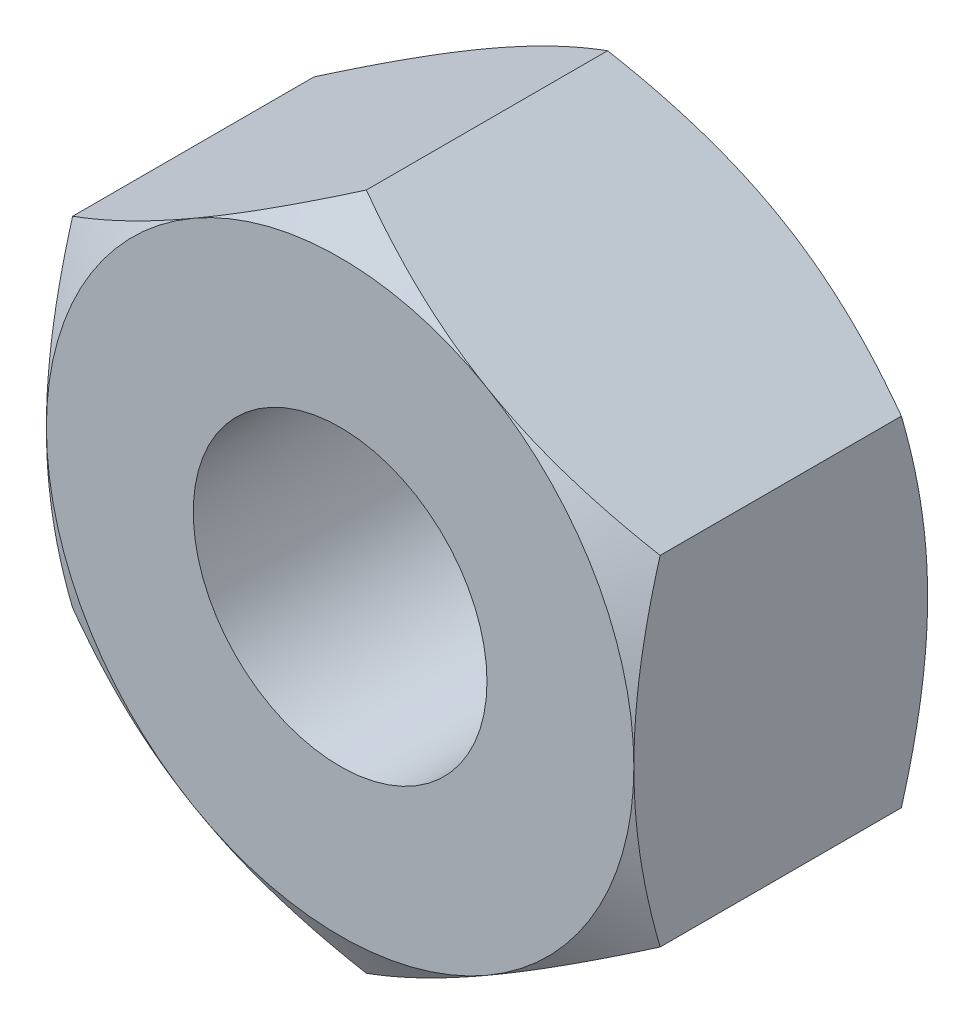
ISO-10303-21;
HEADER;
FILE_DESCRIPTION(('STEP AP214'),'2;1');
FILE_NAME('part.step','',(''),(''),'','','');
FILE_SCHEMA(('AUTOMOTIVE_DESIGN { 1 0 10303 214 1 1 1 1 }'));
ENDSEC;
DATA;
#1=APPLICATION_CONTEXT('core data for automotive mechanical design processes');
#2=APPLICATION_PROTOCOL_DEFINITION('international standard','automotive_design',2000,#1);
#3=PRODUCT_CONTEXT('',#1,'mechanical');
#4=PRODUCT('Part','Part','',(#3));
#5=PRODUCT_RELATED_PRODUCT_CATEGORY('part','',(#4));
#6=PRODUCT_DEFINITION_FORMATION('','',#4);
#7=PRODUCT_DEFINITION_CONTEXT('part definition',#1,'design');
#8=PRODUCT_DEFINITION('design','',#6,#7);
#9=PRODUCT_DEFINITION_SHAPE('','',#8);
#10=(LENGTH_UNIT() NAMED_UNIT(*) SI_UNIT(.MILLI.,.METRE.));
#11=(NAMED_UNIT(*) PLANE_ANGLE_UNIT() SI_UNIT($,.RADIAN.));
#12=(NAMED_UNIT(*) SI_UNIT($,.STERADIAN.) SOLID_ANGLE_UNIT());
#13=UNCERTAINTY_MEASURE_WITH_UNIT(LENGTH_MEASURE(1.E-05),#10,'distance_accuracy_value','');
#14=(GEOMETRIC_REPRESENTATION_CONTEXT(3) GLOBAL_UNCERTAINTY_ASSIGNED_CONTEXT((#13)) GLOBAL_UNIT_ASSIGNED_CONTEXT((#10,
#11,#12)) REPRESENTATION_CONTEXT('',''));
#15=CARTESIAN_POINT('',(0.,0.,0.));
#16=DIRECTION('',(0.,0.,1.));
#17=DIRECTION('',(1.,0.,0.));
#18=AXIS2_PLACEMENT_3D('',#15,#16,#17);
#19=CARTESIAN_POINT('',(0.,3.46410161513776,-3.));
#20=DIRECTION('',(-0.500000000000002,0.866025403784438,0.));
#21=DIRECTION('',(-0.866025403784438,-0.500000000000002,0.));
#22=AXIS2_PLACEMENT_3D('',#19,#20,#21);
#23=PLANE('',#22);
#24=DIRECTION('',(0.,0.,1.));
#25=VECTOR('',#24,1.);
#26=CARTESIAN_POINT('',(-3.,1.73205080756887,-3.));
#27=LINE('',#26,#25);
#28=CARTESIAN_POINT('',(-3.,1.73205080756889,-2.73205080756887));
#29=VERTEX_POINT('',#28);
#30=CARTESIAN_POINT('',(-3.,1.73205080756887,-0.267949192431122));
#31=VERTEX_POINT('',#30);
#32=EDGE_CURVE('E163',#29,#31,#27,.T.);
#33=ORIENTED_EDGE('',*,*,#32,.T.);
#34=CARTESIAN_POINT('',(-3.0002,1.73193533751504,-0.268015862431011));
#35=CARTESIAN_POINT('',(-2.86836479341167,1.80805042952748,-0.224053704452307));
#36=CARTESIAN_POINT('',(-2.73539159464475,1.88482254163056,-0.184071586292629));
#37=CARTESIAN_POINT('',(-2.46714257999794,2.03969618244675,-0.114282080445466));
#38=CARTESIAN_POINT('',(-2.33186199736566,2.11780046324563,-0.0844993822653804));
#39=CARTESIAN_POINT('',(-2.06297739790352,2.27304105912604,-0.0381378392112548));
#40=CARTESIAN_POINT('',(-1.92941475457054,2.35015348720802,-0.0212504411229499));
#41=CARTESIAN_POINT('',(-1.66166094270431,2.50474122256553,-0.00108964244852447));
#42=CARTESIAN_POINT('',(-1.52747074752016,2.58221596787771,0.00220045221891887));
#43=CARTESIAN_POINT('',(-1.2767244023042,2.72698443778646,-0.00464053088539122));
#44=CARTESIAN_POINT('',(-1.16013073502733,2.79429982297457,-0.0130919141926174));
#45=CARTESIAN_POINT('',(-0.927703015025365,2.92849202968484,-0.0398789430070364));
#46=CARTESIAN_POINT('',(-0.81186976634867,2.99536838698943,-0.0582237408617138));
#47=CARTESIAN_POINT('',(-0.578962742943633,3.12983731964849,-0.104084750853329));
#48=CARTESIAN_POINT('',(-0.46191844948606,3.19741287398333,-0.131795385263085));
#49=CARTESIAN_POINT('',(-0.229575649500876,3.33155605209905,-0.194687795137404));
#50=CARTESIAN_POINT('',(-0.114274165828894,3.39812539473503,-0.22985479102156));
#51=CARTESIAN_POINT('',(0.00019999999999989,3.4642170851916,-0.268015862431015));
#52=B_SPLINE_CURVE_WITH_KNOTS('',3,(#34,#35,#36,#37,#38,#39,#40,#41,#42,#43,#44,#45,#46,#47,#48,
#49,#50,#51),.UNSPECIFIED.,.F.,.F.,(4,2,2,2,2,2,2,2,4),(0.,0.475539830103041,0.952222784107964,
1.41710776961288,1.88142182298026,2.28572436316091,2.69040156475039,3.10405572063577,
3.51689749407071),.UNSPECIFIED.);
#53=CARTESIAN_POINT('',(-1.50000000000001,2.59807621135331,0.));
#54=VERTEX_POINT('',#53);
#55=EDGE_CURVE('E132',#31,#54,#52,.T.);
#56=ORIENTED_EDGE('',*,*,#55,.T.);
#57=CARTESIAN_POINT('',(0.,3.46410161513776,-0.267949192431126));
#58=VERTEX_POINT('',#57);
#59=EDGE_CURVE('E52',#54,#58,#52,.T.);
#60=ORIENTED_EDGE('',*,*,#59,.T.);
#61=DIRECTION('',(0.,0.,1.));
#62=VECTOR('',#61,1.);
#63=CARTESIAN_POINT('',(0.,3.46410161513776,-3.));
#64=LINE('',#63,#62);
#65=CARTESIAN_POINT('',(0.,3.46410161513776,-2.73205080756887));
#66=VERTEX_POINT('',#65);
#67=EDGE_CURVE('E148',#66,#58,#64,.T.);
#68=ORIENTED_EDGE('',*,*,#67,.F.);
#69=CARTESIAN_POINT('',(-3.0002,1.73193533751504,-2.73198413756899));
#70=CARTESIAN_POINT('',(-2.86836479341167,1.80805042952748,-2.77594629554769));
#71=CARTESIAN_POINT('',(-2.73539159464475,1.88482254163057,-2.81592841370737));
#72=CARTESIAN_POINT('',(-2.46714257999794,2.03969618244675,-2.88571791955453));
#73=CARTESIAN_POINT('',(-2.33186199736566,2.11780046324563,-2.91550061773462));
#74=CARTESIAN_POINT('',(-2.06297739790352,2.27304105912604,-2.96186216078874));
#75=CARTESIAN_POINT('',(-1.92941475457054,2.35015348720802,-2.97874955887705));
#76=CARTESIAN_POINT('',(-1.66166094270431,2.50474122256553,-2.99891035755148));
#77=CARTESIAN_POINT('',(-1.52747074752016,2.58221596787771,-3.00220045221892));
#78=CARTESIAN_POINT('',(-1.27672440230419,2.72698443778647,-2.99535946911461));
#79=CARTESIAN_POINT('',(-1.16013073502733,2.79429982297457,-2.98690808580738));
#80=CARTESIAN_POINT('',(-0.927703015025365,2.92849202968483,-2.96012105699296));
#81=CARTESIAN_POINT('',(-0.81186976634867,2.99536838698943,-2.94177625913829));
#82=CARTESIAN_POINT('',(-0.578962742943633,3.12983731964849,-2.89591524914667));
#83=CARTESIAN_POINT('',(-0.46191844948606,3.19741287398333,-2.86820461473691));
#84=CARTESIAN_POINT('',(-0.229575649500876,3.33155605209905,-2.8053122048626));
#85=CARTESIAN_POINT('',(-0.114274165828894,3.39812539473503,-2.77014520897844));
#86=CARTESIAN_POINT('',(0.000199999999999608,3.4642170851916,-2.73198413756899));
#87=B_SPLINE_CURVE_WITH_KNOTS('',3,(#69,#70,#71,#72,#73,#74,#75,#76,#77,#78,#79,#80,#81,#82,#83,
#84,#85,#86),.UNSPECIFIED.,.F.,.F.,(4,2,2,2,2,2,2,2,4),(0.,0.475539830103041,0.952222784107965,
1.41710776961288,1.88142182298026,2.28572436316091,2.69040156475039,3.10405572063577,
3.51689749407071),.UNSPECIFIED.);
#88=CARTESIAN_POINT('',(-1.50000000000001,2.59807621135331,-3.));
#89=VERTEX_POINT('',#88);
#90=EDGE_CURVE('E204',#89,#66,#87,.T.);
#91=ORIENTED_EDGE('',*,*,#90,.F.);
#92=EDGE_CURVE('E201',#29,#89,#87,.T.);
#93=ORIENTED_EDGE('',*,*,#92,.F.);
#94=EDGE_LOOP('',(#33,#56,#60,#68,#91,#93));
#95=FACE_BOUND('',#94,.T.);
#96=ADVANCED_FACE('F36',(#95),#23,.T.);
#97=CARTESIAN_POINT('',(3.,1.73205080756887,-3.));
#98=DIRECTION('',(0.500000000000002,0.866025403784438,0.));
#99=DIRECTION('',(-0.866025403784438,0.500000000000002,0.));
#100=AXIS2_PLACEMENT_3D('',#97,#98,#99);
#101=PLANE('',#100);
#102=ORIENTED_EDGE('',*,*,#67,.T.);
#103=CARTESIAN_POINT('',(-0.000200000000000468,3.4642170851916,-0.268015862431014));
#104=CARTESIAN_POINT('',(0.131635206588331,3.38810199317915,-0.22405370445231));
#105=CARTESIAN_POINT('',(0.264608405355248,3.31132988107607,-0.184071586292632));
#106=CARTESIAN_POINT('',(0.532857420002055,3.15645624025988,-0.114282080445468));
#107=CARTESIAN_POINT('',(0.668138002634341,3.078351959461,-0.0844993822653821));
#108=CARTESIAN_POINT('',(0.937022602096483,2.92311136358059,-0.0381378392112558));
#109=CARTESIAN_POINT('',(1.07058524542946,2.84599893549862,-0.0212504411229507));
#110=CARTESIAN_POINT('',(1.33833905729569,2.6914112001411,-0.00108964244852467));
#111=CARTESIAN_POINT('',(1.47252925247984,2.61393645482892,0.00220045221891905));
#112=CARTESIAN_POINT('',(1.72327559769581,2.46916798492017,-0.00464053088539054));
#113=CARTESIAN_POINT('',(1.83986926497268,2.40185259973206,-0.0130919141926165));
#114=CARTESIAN_POINT('',(2.07229698497464,2.2676603930218,-0.039878943007035));
#115=CARTESIAN_POINT('',(2.18813023365133,2.2007840357172,-0.058223740861712));
#116=CARTESIAN_POINT('',(2.42103725705637,2.06631510305815,-0.104084750853327));
#117=CARTESIAN_POINT('',(2.53808155051394,1.99873954872331,-0.131795385263083));
#118=CARTESIAN_POINT('',(2.77042435049913,1.86459637060759,-0.194687795137401));
#119=CARTESIAN_POINT('',(2.88572583417111,1.79802702797161,-0.229854791021557));
#120=CARTESIAN_POINT('',(3.0002,1.73193533751504,-0.268015862431011));
#121=B_SPLINE_CURVE_WITH_KNOTS('',3,(#103,#104,#105,#106,#107,#108,#109,#110,#111,#112,#113,
#114,#115,#116,#117,#118,#119,#120),.UNSPECIFIED.,.F.,.F.,(4,2,2,2,2,2,2,2,4),(0.,
0.475539830103041,0.952222784107966,1.41710776961288,1.88142182298026,2.28572436316091,
2.69040156475039,3.10405572063577,3.51689749407071),.UNSPECIFIED.);
#122=CARTESIAN_POINT('',(1.50000000000001,2.59807621135331,0.));
#123=VERTEX_POINT('',#122);
#124=EDGE_CURVE('E142',#58,#123,#121,.T.);
#125=ORIENTED_EDGE('',*,*,#124,.T.);
#126=CARTESIAN_POINT('',(3.,1.73205080756889,-0.267949192431126));
#127=VERTEX_POINT('',#126);
#128=EDGE_CURVE('E59',#123,#127,#121,.T.);
#129=ORIENTED_EDGE('',*,*,#128,.T.);
#130=DIRECTION('',(0.,0.,1.));
#131=VECTOR('',#130,1.);
#132=CARTESIAN_POINT('',(3.,1.73205080756887,-3.));
#133=LINE('',#132,#131);
#134=CARTESIAN_POINT('',(3.,1.73205080756889,-2.73205080756887));
#135=VERTEX_POINT('',#134);
#136=EDGE_CURVE('E141',#135,#127,#133,.T.);
#137=ORIENTED_EDGE('',*,*,#136,.F.);
#138=CARTESIAN_POINT('',(-0.000200000000000468,3.4642170851916,-2.73198413756899));
#139=CARTESIAN_POINT('',(0.131635206588332,3.38810199317915,-2.77594629554769));
#140=CARTESIAN_POINT('',(0.264608405355249,3.31132988107607,-2.81592841370737));
#141=CARTESIAN_POINT('',(0.532857420002055,3.15645624025988,-2.88571791955453));
#142=CARTESIAN_POINT('',(0.668138002634341,3.078351959461,-2.91550061773462));
#143=CARTESIAN_POINT('',(0.937022602096483,2.92311136358059,-2.96186216078874));
#144=CARTESIAN_POINT('',(1.07058524542946,2.84599893549862,-2.97874955887705));
#145=CARTESIAN_POINT('',(1.33833905729569,2.6914112001411,-2.99891035755148));
#146=CARTESIAN_POINT('',(1.47252925247984,2.61393645482892,-3.00220045221892));
#147=CARTESIAN_POINT('',(1.72327559769581,2.46916798492017,-2.99535946911461));
#148=CARTESIAN_POINT('',(1.83986926497268,2.40185259973206,-2.98690808580738));
#149=CARTESIAN_POINT('',(2.07229698497464,2.2676603930218,-2.96012105699296));
#150=CARTESIAN_POINT('',(2.18813023365133,2.2007840357172,-2.94177625913829));
#151=CARTESIAN_POINT('',(2.42103725705637,2.06631510305815,-2.89591524914667));
#152=CARTESIAN_POINT('',(2.53808155051394,1.99873954872331,-2.86820461473692));
#153=CARTESIAN_POINT('',(2.77042435049912,1.86459637060759,-2.8053122048626));
#154=CARTESIAN_POINT('',(2.88572583417111,1.79802702797161,-2.77014520897844));
#155=CARTESIAN_POINT('',(3.0002,1.73193533751504,-2.73198413756899));
#156=B_SPLINE_CURVE_WITH_KNOTS('',3,(#138,#139,#140,#141,#142,#143,#144,#145,#146,#147,#148,
#149,#150,#151,#152,#153,#154,#155),.UNSPECIFIED.,.F.,.F.,(4,2,2,2,2,2,2,2,4),(0.,
0.475539830103042,0.952222784107966,1.41710776961288,1.88142182298026,2.28572436316091,
2.69040156475039,3.10405572063577,3.51689749407071),.UNSPECIFIED.);
#157=CARTESIAN_POINT('',(1.50000000000001,2.59807621135331,-3.));
#158=VERTEX_POINT('',#157);
#159=EDGE_CURVE('E212',#158,#135,#156,.T.);
#160=ORIENTED_EDGE('',*,*,#159,.F.);
#161=EDGE_CURVE('E213',#66,#158,#156,.T.);
#162=ORIENTED_EDGE('',*,*,#161,.F.);
#163=EDGE_LOOP('',(#102,#125,#129,#137,#160,#162));
#164=FACE_BOUND('',#163,.T.);
#165=ADVANCED_FACE('F139',(#164),#101,.T.);
#166=CARTESIAN_POINT('',(3.,1.73205080756887,-3.));
#167=DIRECTION('',(-1.,0.,0.));
#168=DIRECTION('',(0.,0.,1.));
#169=AXIS2_PLACEMENT_3D('',#166,#167,#168);
#170=PLANE('',#169);
#171=CARTESIAN_POINT('',(3.,-4.5936539924692,-1.43558011593048));
#172=CARTESIAN_POINT('',(3.,-4.46193702779008,-1.37192720307518));
#173=CARTESIAN_POINT('',(3.,-4.32990864071465,-1.30890705285555));
#174=CARTESIAN_POINT('',(3.,-4.06506063583466,-1.18449386009788));
#175=CARTESIAN_POINT('',(3.,-3.93224088584946,-1.12310109927543));
#176=CARTESIAN_POINT('',(3.,-3.66492428764751,-1.00198084729392));
#177=CARTESIAN_POINT('',(3.,-3.53042219167022,-0.942264896297281));
#178=CARTESIAN_POINT('',(3.,-3.26031251060448,-0.825397939065226));
#179=CARTESIAN_POINT('',(3.,-3.12470498357654,-0.768246799131018));
#180=CARTESIAN_POINT('',(3.,-2.85048530058733,-0.656512987795774));
#181=CARTESIAN_POINT('',(3.,-2.71185669617078,-0.601970463161886));
#182=CARTESIAN_POINT('',(3.,-2.43296435096227,-0.497157173219567));
#183=CARTESIAN_POINT('',(3.,-2.29270043021851,-0.44688688317488));
#184=CARTESIAN_POINT('',(3.,-2.01060238690328,-0.351968811323162));
#185=CARTESIAN_POINT('',(3.,-1.86877232784637,-0.307309076087879));
#186=CARTESIAN_POINT('',(3.,-1.58309590976889,-0.225062517408381));
#187=CARTESIAN_POINT('',(3.,-1.43925020389312,-0.187473457257565));
#188=CARTESIAN_POINT('',(3.,-1.1494442452365,-0.121193096215532));
#189=CARTESIAN_POINT('',(3.,-1.00348344023738,-0.0925041644674057));
#190=CARTESIAN_POINT('',(3.,-0.709802044404419,-0.0459556769417578));
#191=CARTESIAN_POINT('',(3.,-0.562081452014834,-0.0280961307387742));
#192=CARTESIAN_POINT('',(3.,-0.266588992220961,-0.00478635986207698));
#193=CARTESIAN_POINT('',(3.,-0.118823483320512,0.00074242557078129));
#194=CARTESIAN_POINT('',(3.,0.176604064205598,-0.000903049781096435));
#195=CARTESIAN_POINT('',(3.,0.32426611973415,-0.00807401311151281));
#196=CARTESIAN_POINT('',(3.,0.576420476419134,-0.0306590509601927));
#197=CARTESIAN_POINT('',(3.,0.681190963786361,-0.0431319720329319));
#198=CARTESIAN_POINT('',(3.,0.889922617976225,-0.0736600577600183));
#199=CARTESIAN_POINT('',(3.,0.993883654507595,-0.0917161027938342));
#200=CARTESIAN_POINT('',(3.,1.30446784089727,-0.153311303212673));
#201=CARTESIAN_POINT('',(3.,1.50963517896541,-0.204261664818864));
#202=CARTESIAN_POINT('',(3.,1.81663689760892,-0.292137269487902));
#203=CARTESIAN_POINT('',(3.,1.92007152271153,-0.323785456358726));
#204=CARTESIAN_POINT('',(3.,2.12586119326052,-0.390213435170821));
#205=CARTESIAN_POINT('',(3.,2.22821692967668,-0.424991067140183));
#206=CARTESIAN_POINT('',(3.,2.43142080387255,-0.496954274385214));
#207=CARTESIAN_POINT('',(3.,2.53227418460128,-0.534125194315124));
#208=CARTESIAN_POINT('',(3.,2.73319845864685,-0.610648765343025));
#209=CARTESIAN_POINT('',(3.,2.8332690167954,-0.650002298222526));
#210=CARTESIAN_POINT('',(3.,2.93297774240013,-0.690231754906343));
#211=B_SPLINE_CURVE_WITH_KNOTS('',3,(#171,#172,#173,#174,#175,#176,#177,#178,#179,#180,#181,
#182,#183,#184,#185,#186,#187,#188,#189,#190,#191,#192,#193,#194,#195,#196,#197,#198,#199,#200,
#201,#202,#203,#204,#205,#206,#207,#208,#209,#210),.UNSPECIFIED.,.F.,.F.,(4,2,2,2,2,2,2,2,2,2,2,
2,2,2,2,2,2,2,2,4),(0.,0.438878844399204,0.877833172949451,1.31929945984492,1.7607427071362,
2.20760550748113,2.65451795408017,3.10046148523201,3.54626371043603,3.99218450300884,
4.4381056898311,4.88117764390528,5.32413457244915,5.64051105619141,5.9569374534813,
6.59026118519872,6.91473961423267,7.23899577837223,7.56142681097228,7.88398906914351),.UNSPECIFIED.);
#212=CARTESIAN_POINT('',(3.,-1.73205080756889,-0.267949192431126));
#213=VERTEX_POINT('',#212);
#214=CARTESIAN_POINT('',(3.,0.,0.));
#215=VERTEX_POINT('',#214);
#216=EDGE_CURVE('E134',#213,#215,#211,.T.);
#217=ORIENTED_EDGE('',*,*,#216,.F.);
#218=DIRECTION('',(0.,0.,1.));
#219=VECTOR('',#218,1.);
#220=CARTESIAN_POINT('',(3.,-1.73205080756889,-3.));
#221=LINE('',#220,#219);
#222=CARTESIAN_POINT('',(3.,-1.73205080756889,-2.73205080756887));
#223=VERTEX_POINT('',#222);
#224=EDGE_CURVE('E149',#223,#213,#221,.T.);
#225=ORIENTED_EDGE('',*,*,#224,.F.);
#226=CARTESIAN_POINT('',(3.,-4.5936539924692,-1.56441988406951));
#227=CARTESIAN_POINT('',(3.,-4.46193702779008,-1.62807279692482));
#228=CARTESIAN_POINT('',(3.,-4.32990864071465,-1.69109294714445));
#229=CARTESIAN_POINT('',(3.,-4.06506063583466,-1.81550613990212));
#230=CARTESIAN_POINT('',(3.,-3.93224088584946,-1.87689890072457));
#231=CARTESIAN_POINT('',(3.,-3.66492428764751,-1.99801915270608));
#232=CARTESIAN_POINT('',(3.,-3.53042219167022,-2.05773510370272));
#233=CARTESIAN_POINT('',(3.,-3.26031251060448,-2.17460206093477));
#234=CARTESIAN_POINT('',(3.,-3.12470498357654,-2.23175320086898));
#235=CARTESIAN_POINT('',(3.,-2.85048530058734,-2.34348701220423));
#236=CARTESIAN_POINT('',(3.,-2.71185669617078,-2.39802953683811));
#237=CARTESIAN_POINT('',(3.,-2.43296435096227,-2.50284282678043));
#238=CARTESIAN_POINT('',(3.,-2.29270043021851,-2.55311311682512));
#239=CARTESIAN_POINT('',(3.,-2.01060238690328,-2.64803118867684));
#240=CARTESIAN_POINT('',(3.,-1.86877232784637,-2.69269092391212));
#241=CARTESIAN_POINT('',(3.,-1.58309590976889,-2.77493748259162));
#242=CARTESIAN_POINT('',(3.,-1.43925020389312,-2.81252654274243));
#243=CARTESIAN_POINT('',(3.,-1.1494442452365,-2.87880690378447));
#244=CARTESIAN_POINT('',(3.,-1.00348344023738,-2.90749583553259));
#245=CARTESIAN_POINT('',(3.,-0.709802044404419,-2.95404432305824));
#246=CARTESIAN_POINT('',(3.,-0.562081452014834,-2.97190386926123));
#247=CARTESIAN_POINT('',(3.,-0.26658899222096,-2.99521364013792));
#248=CARTESIAN_POINT('',(3.,-0.118823483320512,-3.00074242557078));
#249=CARTESIAN_POINT('',(3.,0.176604064205598,-2.9990969502189));
#250=CARTESIAN_POINT('',(3.,0.324266119734151,-2.99192598688849));
#251=CARTESIAN_POINT('',(3.,0.576420476419134,-2.96934094903981));
#252=CARTESIAN_POINT('',(3.,0.681190963786361,-2.95686802796707));
#253=CARTESIAN_POINT('',(3.,0.889922617976226,-2.92633994223998));
#254=CARTESIAN_POINT('',(3.,0.993883654507595,-2.90828389720617));
#255=CARTESIAN_POINT('',(3.,1.30446784089726,-2.84668869678733));
#256=CARTESIAN_POINT('',(3.,1.50963517896541,-2.79573833518114));
#257=CARTESIAN_POINT('',(3.,1.81663689760892,-2.7078627305121));
#258=CARTESIAN_POINT('',(3.,1.92007152271153,-2.67621454364127));
#259=CARTESIAN_POINT('',(3.,2.12586119326052,-2.60978656482918));
#260=CARTESIAN_POINT('',(3.,2.22821692967667,-2.57500893285982));
#261=CARTESIAN_POINT('',(3.,2.43142080387255,-2.50304572561479));
#262=CARTESIAN_POINT('',(3.,2.53227418460128,-2.46587480568488));
#263=CARTESIAN_POINT('',(3.,2.73319845864685,-2.38935123465697));
#264=CARTESIAN_POINT('',(3.,2.8332690167954,-2.34999770177747));
#265=CARTESIAN_POINT('',(3.,2.93297774240012,-2.30976824509366));
#266=B_SPLINE_CURVE_WITH_KNOTS('',3,(#226,#227,#228,#229,#230,#231,#232,#233,#234,#235,#236,
#237,#238,#239,#240,#241,#242,#243,#244,#245,#246,#247,#248,#249,#250,#251,#252,#253,#254,#255,
#256,#257,#258,#259,#260,#261,#262,#263,#264,#265),.UNSPECIFIED.,.F.,.F.,(4,2,2,2,2,2,2,2,2,2,2,
2,2,2,2,2,2,2,2,4),(0.,0.438878844399204,0.877833172949452,1.31929945984492,1.7607427071362,
2.20760550748113,2.65451795408017,3.10046148523201,3.54626371043604,3.99218450300884,
4.4381056898311,4.88117764390528,5.32413457244915,5.64051105619141,5.9569374534813,
6.59026118519872,6.91473961423267,7.23899577837223,7.56142681097228,7.88398906914351),.UNSPECIFIED.);
#267=CARTESIAN_POINT('',(3.,0.,-3.));
#268=VERTEX_POINT('',#267);
#269=EDGE_CURVE('E187',#223,#268,#266,.T.);
#270=ORIENTED_EDGE('',*,*,#269,.T.);
#271=EDGE_CURVE('E147',#268,#135,#266,.T.);
#272=ORIENTED_EDGE('',*,*,#271,.T.);
#273=ORIENTED_EDGE('',*,*,#136,.T.);
#274=EDGE_CURVE('E124',#215,#127,#211,.T.);
#275=ORIENTED_EDGE('',*,*,#274,.F.);
#276=EDGE_LOOP('',(#217,#225,#270,#272,#273,#275));
#277=FACE_BOUND('',#276,.T.);
#278=ADVANCED_FACE('F145',(#277),#170,.F.);
#279=CARTESIAN_POINT('',(0.,-3.46410161513777,-3.));
#280=DIRECTION('',(0.500000000000002,-0.866025403784438,0.));
#281=DIRECTION('',(0.866025403784438,0.500000000000002,0.));
#282=AXIS2_PLACEMENT_3D('',#279,#280,#281);
#283=PLANE('',#282);
#284=ORIENTED_EDGE('',*,*,#224,.T.);
#285=CARTESIAN_POINT('',(3.0002,-1.73193533751505,-0.268015862431014));
#286=CARTESIAN_POINT('',(2.86836479341167,-1.80805042952749,-0.22405370445231));
#287=CARTESIAN_POINT('',(2.73539159464475,-1.88482254163058,-0.184071586292632));
#288=CARTESIAN_POINT('',(2.46714257999794,-2.03969618244676,-0.11428208044547));
#289=CARTESIAN_POINT('',(2.33186199736566,-2.11780046324564,-0.0844993822653846));
#290=CARTESIAN_POINT('',(2.06297739790352,-2.27304105912606,-0.0381378392112593));
#291=CARTESIAN_POINT('',(1.92941475457054,-2.35015348720803,-0.0212504411229545));
#292=CARTESIAN_POINT('',(1.66166094270431,-2.50474122256555,-0.00108964244852956));
#293=CARTESIAN_POINT('',(1.52747074752016,-2.58221596787773,0.00220045221891347));
#294=CARTESIAN_POINT('',(1.27672440230419,-2.72698443778648,-0.00464053088539715));
#295=CARTESIAN_POINT('',(1.16013073502732,-2.79429982297458,-0.0130919141926234));
#296=CARTESIAN_POINT('',(0.927703015025363,-2.92849202968485,-0.0398789430070428));
#297=CARTESIAN_POINT('',(0.811869766348668,-2.99536838698945,-0.0582237408617204));
#298=CARTESIAN_POINT('',(0.578962742943632,-3.1298373196485,-0.104084750853336));
#299=CARTESIAN_POINT('',(0.461918449486059,-3.19741287398334,-0.131795385263092));
#300=CARTESIAN_POINT('',(0.229575649500875,-3.33155605209906,-0.194687795137411));
#301=CARTESIAN_POINT('',(0.114274165828893,-3.39812539473504,-0.229854791021566));
#302=CARTESIAN_POINT('',(-0.000200000000000371,-3.46421708519161,-0.268015862431021));
#303=B_SPLINE_CURVE_WITH_KNOTS('',3,(#285,#286,#287,#288,#289,#290,#291,#292,#293,#294,#295,
#296,#297,#298,#299,#300,#301,#302),.UNSPECIFIED.,.F.,.F.,(4,2,2,2,2,2,2,2,4),(0.,
0.475539830103041,0.952222784107966,1.41710776961288,1.88142182298026,2.28572436316091,
2.69040156475039,3.10405572063577,3.51689749407071),.UNSPECIFIED.);
#304=CARTESIAN_POINT('',(1.50000000000001,-2.59807621135331,0.));
#305=VERTEX_POINT('',#304);
#306=EDGE_CURVE('E271',#213,#305,#303,.T.);
#307=ORIENTED_EDGE('',*,*,#306,.T.);
#308=CARTESIAN_POINT('',(0.,-3.46410161513776,-0.267949192431126));
#309=VERTEX_POINT('',#308);
#310=EDGE_CURVE('E265',#305,#309,#303,.T.);
#311=ORIENTED_EDGE('',*,*,#310,.T.);
#312=DIRECTION('',(0.,0.,1.));
#313=VECTOR('',#312,1.);
#314=CARTESIAN_POINT('',(0.,-3.46410161513777,-3.));
#315=LINE('',#314,#313);
#316=CARTESIAN_POINT('',(0.,-3.46410161513776,-2.73205080756887));
#317=VERTEX_POINT('',#316);
#318=EDGE_CURVE('E154',#317,#309,#315,.T.);
#319=ORIENTED_EDGE('',*,*,#318,.F.);
#320=CARTESIAN_POINT('',(3.0002,-1.73193533751505,-2.73198413756899));
#321=CARTESIAN_POINT('',(2.86836479341167,-1.80805042952749,-2.77594629554769));
#322=CARTESIAN_POINT('',(2.73539159464475,-1.88482254163058,-2.81592841370737));
#323=CARTESIAN_POINT('',(2.46714257999794,-2.03969618244676,-2.88571791955453));
#324=CARTESIAN_POINT('',(2.33186199736566,-2.11780046324564,-2.91550061773462));
#325=CARTESIAN_POINT('',(2.06297739790352,-2.27304105912606,-2.96186216078874));
#326=CARTESIAN_POINT('',(1.92941475457054,-2.35015348720803,-2.97874955887705));
#327=CARTESIAN_POINT('',(1.66166094270431,-2.50474122256555,-2.99891035755147));
#328=CARTESIAN_POINT('',(1.52747074752016,-2.58221596787773,-3.00220045221891));
#329=CARTESIAN_POINT('',(1.27672440230419,-2.72698443778648,-2.9953594691146));
#330=CARTESIAN_POINT('',(1.16013073502732,-2.79429982297458,-2.98690808580738));
#331=CARTESIAN_POINT('',(0.927703015025362,-2.92849202968485,-2.96012105699296));
#332=CARTESIAN_POINT('',(0.811869766348668,-2.99536838698945,-2.94177625913828));
#333=CARTESIAN_POINT('',(0.578962742943632,-3.1298373196485,-2.89591524914666));
#334=CARTESIAN_POINT('',(0.461918449486059,-3.19741287398334,-2.86820461473691));
#335=CARTESIAN_POINT('',(0.229575649500875,-3.33155605209906,-2.80531220486259));
#336=CARTESIAN_POINT('',(0.114274165828894,-3.39812539473504,-2.77014520897843));
#337=CARTESIAN_POINT('',(-0.000200000000000133,-3.46421708519161,-2.73198413756898));
#338=B_SPLINE_CURVE_WITH_KNOTS('',3,(#320,#321,#322,#323,#324,#325,#326,#327,#328,#329,#330,
#331,#332,#333,#334,#335,#336,#337),.UNSPECIFIED.,.F.,.F.,(4,2,2,2,2,2,2,2,4),(0.,
0.475539830103042,0.952222784107966,1.41710776961288,1.88142182298026,2.28572436316091,
2.69040156475039,3.10405572063577,3.51689749407071),.UNSPECIFIED.);
#339=CARTESIAN_POINT('',(1.5,-2.59807621135331,-3.));
#340=VERTEX_POINT('',#339);
#341=EDGE_CURVE('E205',#340,#317,#338,.T.);
#342=ORIENTED_EDGE('',*,*,#341,.F.);
#343=EDGE_CURVE('E189',#223,#340,#338,.T.);
#344=ORIENTED_EDGE('',*,*,#343,.F.);
#345=EDGE_LOOP('',(#284,#307,#311,#319,#342,#344));
#346=FACE_BOUND('',#345,.T.);
#347=ADVANCED_FACE('F256',(#346),#283,.T.);
#348=CARTESIAN_POINT('',(-3.,-1.73205080756889,-3.));
#349=DIRECTION('',(-0.500000000000002,-0.866025403784438,0.));
#350=DIRECTION('',(0.866025403784438,-0.500000000000002,0.));
#351=AXIS2_PLACEMENT_3D('',#348,#349,#350);
#352=PLANE('',#351);
#353=ORIENTED_EDGE('',*,*,#318,.T.);
#354=CARTESIAN_POINT('',(0.0002,-3.46421708519161,-0.268015862431021));
#355=CARTESIAN_POINT('',(-0.131635206588332,-3.38810199317916,-0.224053704452316));
#356=CARTESIAN_POINT('',(-0.26460840535525,-3.31132988107608,-0.184071586292638));
#357=CARTESIAN_POINT('',(-0.532857420002057,-3.15645624025989,-0.114282080445474));
#358=CARTESIAN_POINT('',(-0.668138002634344,-3.07835195946101,-0.0844993822653882));
#359=CARTESIAN_POINT('',(-0.937022602096486,-2.9231113635806,-0.0381378392112617));
#360=CARTESIAN_POINT('',(-1.07058524542946,-2.84599893549863,-0.0212504411229563));
#361=CARTESIAN_POINT('',(-1.3383390572957,-2.69141120014111,-0.00108964244853018));
#362=CARTESIAN_POINT('',(-1.47252925247985,-2.61393645482893,0.00220045221891338));
#363=CARTESIAN_POINT('',(-1.72327559769581,-2.46916798492018,-0.00464053088539624));
#364=CARTESIAN_POINT('',(-1.83986926497268,-2.40185259973207,-0.013091914192622));
#365=CARTESIAN_POINT('',(-2.07229698497464,-2.26766039302181,-0.0398789430070403));
#366=CARTESIAN_POINT('',(-2.18813023365133,-2.20078403571721,-0.0582237408617173));
#367=CARTESIAN_POINT('',(-2.42103725705637,-2.06631510305816,-0.104084750853332));
#368=CARTESIAN_POINT('',(-2.53808155051394,-1.99873954872332,-0.131795385263087));
#369=CARTESIAN_POINT('',(-2.77042435049913,-1.8645963706076,-0.194687795137405));
#370=CARTESIAN_POINT('',(-2.88572583417111,-1.79802702797162,-0.22985479102156));
#371=CARTESIAN_POINT('',(-3.0002,-1.73193533751505,-0.268015862431014));
#372=B_SPLINE_CURVE_WITH_KNOTS('',3,(#354,#355,#356,#357,#358,#359,#360,#361,#362,#363,#364,
#365,#366,#367,#368,#369,#370,#371),.UNSPECIFIED.,.F.,.F.,(4,2,2,2,2,2,2,2,4),(0.,
0.475539830103043,0.952222784107969,1.41710776961289,1.88142182298027,2.28572436316092,
2.69040156475039,3.10405572063577,3.51689749407071),.UNSPECIFIED.);
#373=CARTESIAN_POINT('',(-1.50000000000001,-2.59807621135331,0.));
#374=VERTEX_POINT('',#373);
#375=EDGE_CURVE('E272',#309,#374,#372,.T.);
#376=ORIENTED_EDGE('',*,*,#375,.T.);
#377=CARTESIAN_POINT('',(-3.,-1.73205080756889,-0.267949192431126));
#378=VERTEX_POINT('',#377);
#379=EDGE_CURVE('E273',#374,#378,#372,.T.);
#380=ORIENTED_EDGE('',*,*,#379,.T.);
#381=DIRECTION('',(0.,0.,1.));
#382=VECTOR('',#381,1.);
#383=CARTESIAN_POINT('',(-3.,-1.73205080756889,-3.));
#384=LINE('',#383,#382);
#385=CARTESIAN_POINT('',(-3.,-1.73205080756889,-2.73205080756887));
#386=VERTEX_POINT('',#385);
#387=EDGE_CURVE('E160',#386,#378,#384,.T.);
#388=ORIENTED_EDGE('',*,*,#387,.F.);
#389=CARTESIAN_POINT('',(0.0002,-3.46421708519161,-2.73198413756898));
#390=CARTESIAN_POINT('',(-0.131635206588332,-3.38810199317916,-2.77594629554768));
#391=CARTESIAN_POINT('',(-0.26460840535525,-3.31132988107608,-2.81592841370736));
#392=CARTESIAN_POINT('',(-0.532857420002057,-3.15645624025989,-2.88571791955453));
#393=CARTESIAN_POINT('',(-0.668138002634344,-3.07835195946101,-2.91550061773461));
#394=CARTESIAN_POINT('',(-0.937022602096487,-2.9231113635806,-2.96186216078874));
#395=CARTESIAN_POINT('',(-1.07058524542946,-2.84599893549863,-2.97874955887704));
#396=CARTESIAN_POINT('',(-1.3383390572957,-2.69141120014111,-2.99891035755147));
#397=CARTESIAN_POINT('',(-1.47252925247985,-2.61393645482893,-3.00220045221891));
#398=CARTESIAN_POINT('',(-1.72327559769581,-2.46916798492017,-2.9953594691146));
#399=CARTESIAN_POINT('',(-1.83986926497268,-2.40185259973207,-2.98690808580738));
#400=CARTESIAN_POINT('',(-2.07229698497464,-2.26766039302181,-2.96012105699296));
#401=CARTESIAN_POINT('',(-2.18813023365133,-2.20078403571721,-2.94177625913828));
#402=CARTESIAN_POINT('',(-2.42103725705637,-2.06631510305816,-2.89591524914667));
#403=CARTESIAN_POINT('',(-2.53808155051394,-1.99873954872332,-2.86820461473691));
#404=CARTESIAN_POINT('',(-2.77042435049913,-1.8645963706076,-2.80531220486259));
#405=CARTESIAN_POINT('',(-2.88572583417111,-1.79802702797162,-2.77014520897844));
#406=CARTESIAN_POINT('',(-3.0002,-1.73193533751505,-2.73198413756899));
#407=B_SPLINE_CURVE_WITH_KNOTS('',3,(#389,#390,#391,#392,#393,#394,#395,#396,#397,#398,#399,
#400,#401,#402,#403,#404,#405,#406),.UNSPECIFIED.,.F.,.F.,(4,2,2,2,2,2,2,2,4),(0.,
0.475539830103043,0.952222784107969,1.41710776961289,1.88142182298027,2.28572436316092,
2.69040156475039,3.10405572063577,3.51689749407071),.UNSPECIFIED.);
#408=CARTESIAN_POINT('',(-1.5,-2.59807621135331,-3.));
#409=VERTEX_POINT('',#408);
#410=EDGE_CURVE('E245',#409,#386,#407,.T.);
#411=ORIENTED_EDGE('',*,*,#410,.F.);
#412=EDGE_CURVE('E255',#317,#409,#407,.T.);
#413=ORIENTED_EDGE('',*,*,#412,.F.);
#414=EDGE_LOOP('',(#353,#376,#380,#388,#411,#413));
#415=FACE_BOUND('',#414,.T.);
#416=ADVANCED_FACE('F259',(#415),#352,.T.);
#417=CARTESIAN_POINT('',(-3.,1.73205080756887,-3.));
#418=DIRECTION('',(-1.,0.,0.));
#419=DIRECTION('',(0.,0.,1.));
#420=AXIS2_PLACEMENT_3D('',#417,#418,#419);
#421=PLANE('',#420);
#422=ORIENTED_EDGE('',*,*,#387,.T.);
#423=CARTESIAN_POINT('',(-3.,-4.5936539924692,-1.43558011593048));
#424=CARTESIAN_POINT('',(-3.,-4.46193702779008,-1.37192720307518));
#425=CARTESIAN_POINT('',(-3.,-4.32990864071465,-1.30890705285555));
#426=CARTESIAN_POINT('',(-3.,-4.06506063583466,-1.18449386009788));
#427=CARTESIAN_POINT('',(-3.,-3.93224088584946,-1.12310109927543));
#428=CARTESIAN_POINT('',(-3.,-3.66492428764751,-1.00198084729392));
#429=CARTESIAN_POINT('',(-3.,-3.53042219167022,-0.942264896297281));
#430=CARTESIAN_POINT('',(-3.,-3.26031251060448,-0.825397939065226));
#431=CARTESIAN_POINT('',(-3.,-3.12470498357654,-0.768246799131018));
#432=CARTESIAN_POINT('',(-3.,-2.85048530058733,-0.656512987795774));
#433=CARTESIAN_POINT('',(-3.,-2.71185669617078,-0.601970463161886));
#434=CARTESIAN_POINT('',(-3.,-2.43296435096227,-0.497157173219567));
#435=CARTESIAN_POINT('',(-3.,-2.29270043021851,-0.44688688317488));
#436=CARTESIAN_POINT('',(-3.,-2.01060238690328,-0.351968811323162));
#437=CARTESIAN_POINT('',(-3.,-1.86877232784637,-0.307309076087879));
#438=CARTESIAN_POINT('',(-3.,-1.58309590976889,-0.225062517408381));
#439=CARTESIAN_POINT('',(-3.,-1.43925020389312,-0.187473457257565));
#440=CARTESIAN_POINT('',(-3.,-1.1494442452365,-0.121193096215532));
#441=CARTESIAN_POINT('',(-3.,-1.00348344023738,-0.0925041644674057));
#442=CARTESIAN_POINT('',(-3.,-0.709802044404419,-0.0459556769417578));
#443=CARTESIAN_POINT('',(-3.,-0.562081452014834,-0.0280961307387742));
#444=CARTESIAN_POINT('',(-3.,-0.266588992220961,-0.00478635986207698));
#445=CARTESIAN_POINT('',(-3.,-0.118823483320512,0.00074242557078129));
#446=CARTESIAN_POINT('',(-3.,0.176604064205598,-0.000903049781096435));
#447=CARTESIAN_POINT('',(-3.,0.32426611973415,-0.00807401311151281));
#448=CARTESIAN_POINT('',(-3.,0.576420476419134,-0.0306590509601927));
#449=CARTESIAN_POINT('',(-3.,0.681190963786361,-0.0431319720329319));
#450=CARTESIAN_POINT('',(-3.,0.889922617976225,-0.0736600577600183));
#451=CARTESIAN_POINT('',(-3.,0.993883654507595,-0.0917161027938342));
#452=CARTESIAN_POINT('',(-3.,1.30446784089727,-0.153311303212673));
#453=CARTESIAN_POINT('',(-3.,1.50963517896541,-0.204261664818864));
#454=CARTESIAN_POINT('',(-3.,1.81663689760892,-0.292137269487902));
#455=CARTESIAN_POINT('',(-3.,1.92007152271153,-0.323785456358726));
#456=CARTESIAN_POINT('',(-3.,2.12586119326052,-0.390213435170821));
#457=CARTESIAN_POINT('',(-3.,2.22821692967668,-0.424991067140183));
#458=CARTESIAN_POINT('',(-3.,2.43142080387255,-0.496954274385214));
#459=CARTESIAN_POINT('',(-3.,2.53227418460128,-0.534125194315124));
#460=CARTESIAN_POINT('',(-3.,2.73319845864685,-0.610648765343025));
#461=CARTESIAN_POINT('',(-3.,2.8332690167954,-0.650002298222526));
#462=CARTESIAN_POINT('',(-3.,2.93297774240013,-0.690231754906343));
#463=B_SPLINE_CURVE_WITH_KNOTS('',3,(#423,#424,#425,#426,#427,#428,#429,#430,#431,#432,#433,
#434,#435,#436,#437,#438,#439,#440,#441,#442,#443,#444,#445,#446,#447,#448,#449,#450,#451,#452,
#453,#454,#455,#456,#457,#458,#459,#460,#461,#462),.UNSPECIFIED.,.F.,.F.,(4,2,2,2,2,2,2,2,2,2,2,
2,2,2,2,2,2,2,2,4),(0.,0.438878844399204,0.877833172949451,1.31929945984492,1.7607427071362,
2.20760550748113,2.65451795408017,3.10046148523201,3.54626371043603,3.99218450300884,
4.4381056898311,4.88117764390528,5.32413457244915,5.64051105619141,5.9569374534813,
6.59026118519872,6.91473961423267,7.23899577837223,7.56142681097228,7.88398906914351),.UNSPECIFIED.);
#464=CARTESIAN_POINT('',(-3.,0.,0.));
#465=VERTEX_POINT('',#464);
#466=EDGE_CURVE('E448',#378,#465,#463,.T.);
#467=ORIENTED_EDGE('',*,*,#466,.T.);
#468=EDGE_CURVE('E443',#465,#31,#463,.T.);
#469=ORIENTED_EDGE('',*,*,#468,.T.);
#470=ORIENTED_EDGE('',*,*,#32,.F.);
#471=CARTESIAN_POINT('',(-3.,-4.5936539924692,-1.56441988406951));
#472=CARTESIAN_POINT('',(-3.,-4.46193702779008,-1.62807279692482));
#473=CARTESIAN_POINT('',(-3.,-4.32990864071465,-1.69109294714445));
#474=CARTESIAN_POINT('',(-3.,-4.06506063583466,-1.81550613990212));
#475=CARTESIAN_POINT('',(-3.,-3.93224088584946,-1.87689890072457));
#476=CARTESIAN_POINT('',(-3.,-3.66492428764751,-1.99801915270608));
#477=CARTESIAN_POINT('',(-3.,-3.53042219167022,-2.05773510370272));
#478=CARTESIAN_POINT('',(-3.,-3.26031251060448,-2.17460206093477));
#479=CARTESIAN_POINT('',(-3.,-3.12470498357654,-2.23175320086898));
#480=CARTESIAN_POINT('',(-3.,-2.85048530058734,-2.34348701220423));
#481=CARTESIAN_POINT('',(-3.,-2.71185669617078,-2.39802953683811));
#482=CARTESIAN_POINT('',(-3.,-2.43296435096227,-2.50284282678043));
#483=CARTESIAN_POINT('',(-3.,-2.29270043021851,-2.55311311682512));
#484=CARTESIAN_POINT('',(-3.,-2.01060238690328,-2.64803118867684));
#485=CARTESIAN_POINT('',(-3.,-1.86877232784637,-2.69269092391212));
#486=CARTESIAN_POINT('',(-3.,-1.58309590976889,-2.77493748259162));
#487=CARTESIAN_POINT('',(-3.,-1.43925020389312,-2.81252654274243));
#488=CARTESIAN_POINT('',(-3.,-1.1494442452365,-2.87880690378447));
#489=CARTESIAN_POINT('',(-3.,-1.00348344023738,-2.90749583553259));
#490=CARTESIAN_POINT('',(-3.,-0.709802044404419,-2.95404432305824));
#491=CARTESIAN_POINT('',(-3.,-0.562081452014834,-2.97190386926123));
#492=CARTESIAN_POINT('',(-3.,-0.26658899222096,-2.99521364013792));
#493=CARTESIAN_POINT('',(-3.,-0.118823483320512,-3.00074242557078));
#494=CARTESIAN_POINT('',(-3.,0.176604064205598,-2.9990969502189));
#495=CARTESIAN_POINT('',(-3.,0.324266119734151,-2.99192598688849));
#496=CARTESIAN_POINT('',(-3.,0.576420476419134,-2.96934094903981));
#497=CARTESIAN_POINT('',(-3.,0.681190963786361,-2.95686802796707));
#498=CARTESIAN_POINT('',(-3.,0.889922617976226,-2.92633994223998));
#499=CARTESIAN_POINT('',(-3.,0.993883654507595,-2.90828389720617));
#500=CARTESIAN_POINT('',(-3.,1.30446784089726,-2.84668869678733));
#501=CARTESIAN_POINT('',(-3.,1.50963517896541,-2.79573833518114));
#502=CARTESIAN_POINT('',(-3.,1.81663689760892,-2.7078627305121));
#503=CARTESIAN_POINT('',(-3.,1.92007152271153,-2.67621454364127));
#504=CARTESIAN_POINT('',(-3.,2.12586119326052,-2.60978656482918));
#505=CARTESIAN_POINT('',(-3.,2.22821692967667,-2.57500893285982));
#506=CARTESIAN_POINT('',(-3.,2.43142080387255,-2.50304572561479));
#507=CARTESIAN_POINT('',(-3.,2.53227418460128,-2.46587480568488));
#508=CARTESIAN_POINT('',(-3.,2.73319845864685,-2.38935123465697));
#509=CARTESIAN_POINT('',(-3.,2.8332690167954,-2.34999770177747));
#510=CARTESIAN_POINT('',(-3.,2.93297774240012,-2.30976824509366));
#511=B_SPLINE_CURVE_WITH_KNOTS('',3,(#471,#472,#473,#474,#475,#476,#477,#478,#479,#480,#481,
#482,#483,#484,#485,#486,#487,#488,#489,#490,#491,#492,#493,#494,#495,#496,#497,#498,#499,#500,
#501,#502,#503,#504,#505,#506,#507,#508,#509,#510),.UNSPECIFIED.,.F.,.F.,(4,2,2,2,2,2,2,2,2,2,2,
2,2,2,2,2,2,2,2,4),(0.,0.438878844399204,0.877833172949452,1.31929945984492,1.7607427071362,
2.20760550748113,2.65451795408017,3.10046148523201,3.54626371043604,3.99218450300884,
4.4381056898311,4.88117764390528,5.32413457244915,5.64051105619141,5.9569374534813,
6.59026118519872,6.91473961423267,7.23899577837223,7.56142681097228,7.88398906914351),.UNSPECIFIED.);
#512=CARTESIAN_POINT('',(-3.,0.,-3.));
#513=VERTEX_POINT('',#512);
#514=EDGE_CURVE('E198',#513,#29,#511,.T.);
#515=ORIENTED_EDGE('',*,*,#514,.F.);
#516=EDGE_CURVE('E469',#386,#513,#511,.T.);
#517=ORIENTED_EDGE('',*,*,#516,.F.);
#518=EDGE_LOOP('',(#422,#467,#469,#470,#515,#517));
#519=FACE_BOUND('',#518,.T.);
#520=ADVANCED_FACE('F328',(#519),#421,.T.);
#521=CARTESIAN_POINT('',(0.,3.46410161513776,0.));
#522=DIRECTION('',(0.,0.,-1.));
#523=DIRECTION('',(-1.,0.,0.));
#524=AXIS2_PLACEMENT_3D('',#521,#522,#523);
#525=PLANE('',#524);
#526=CARTESIAN_POINT('',(0.,0.,0.));
#527=DIRECTION('',(0.,0.,1.));
#528=DIRECTION('',(1.,0.,0.));
#529=AXIS2_PLACEMENT_3D('',#526,#527,#528);
#530=CIRCLE('',#529,1.5);
#531=CARTESIAN_POINT('',(1.5,0.,0.));
#532=VERTEX_POINT('',#531);
#533=EDGE_CURVE('E295',#532,#532,#530,.T.);
#534=ORIENTED_EDGE('',*,*,#533,.F.);
#535=EDGE_LOOP('',(#534));
#536=FACE_BOUND('',#535,.T.);
#537=CARTESIAN_POINT('',(0.,0.,0.));
#538=DIRECTION('',(0.,0.,-1.));
#539=DIRECTION('',(-1.,0.,0.));
#540=AXIS2_PLACEMENT_3D('',#537,#538,#539);
#541=CIRCLE('',#540,3.);
#542=EDGE_CURVE('E11',#465,#54,#541,.T.);
#543=ORIENTED_EDGE('',*,*,#542,.F.);
#544=EDGE_CURVE('E40',#374,#465,#541,.T.);
#545=ORIENTED_EDGE('',*,*,#544,.F.);
#546=EDGE_CURVE('E179',#305,#374,#541,.T.);
#547=ORIENTED_EDGE('',*,*,#546,.F.);
#548=EDGE_CURVE('E464',#215,#305,#541,.T.);
#549=ORIENTED_EDGE('',*,*,#548,.F.);
#550=CARTESIAN_POINT('',(0.,0.,0.));
#551=DIRECTION('',(0.,0.,1.));
#552=DIRECTION('',(1.,0.,0.));
#553=AXIS2_PLACEMENT_3D('',#550,#551,#552);
#554=CIRCLE('',#553,3.);
#555=EDGE_CURVE('E127',#215,#123,#554,.T.);
#556=ORIENTED_EDGE('',*,*,#555,.T.);
#557=EDGE_CURVE('E45',#54,#123,#541,.T.);
#558=ORIENTED_EDGE('',*,*,#557,.F.);
#559=EDGE_LOOP('',(#543,#545,#547,#549,#556,#558));
#560=FACE_BOUND('',#559,.T.);
#561=ADVANCED_FACE('F308',(#536,#560),#525,.F.);
#562=CARTESIAN_POINT('',(0.,3.46410161513776,-3.));
#563=DIRECTION('',(0.,0.,-1.));
#564=DIRECTION('',(-1.,0.,0.));
#565=AXIS2_PLACEMENT_3D('',#562,#563,#564);
#566=PLANE('',#565);
#567=CARTESIAN_POINT('',(0.,0.,-3.));
#568=DIRECTION('',(0.,0.,-1.));
#569=DIRECTION('',(-1.,0.,0.));
#570=AXIS2_PLACEMENT_3D('',#567,#568,#569);
#571=CIRCLE('',#570,3.);
#572=EDGE_CURVE('E168',#513,#409,#571,.F.);
#573=ORIENTED_EDGE('',*,*,#572,.F.);
#574=EDGE_CURVE('E151',#89,#513,#571,.F.);
#575=ORIENTED_EDGE('',*,*,#574,.F.);
#576=EDGE_CURVE('E167',#158,#89,#571,.F.);
#577=ORIENTED_EDGE('',*,*,#576,.F.);
#578=CARTESIAN_POINT('',(0.,0.,-3.));
#579=DIRECTION('',(0.,0.,1.));
#580=DIRECTION('',(1.,0.,0.));
#581=AXIS2_PLACEMENT_3D('',#578,#579,#580);
#582=CIRCLE('',#581,3.);
#583=EDGE_CURVE('E194',#268,#158,#582,.T.);
#584=ORIENTED_EDGE('',*,*,#583,.F.);
#585=EDGE_CURVE('E173',#340,#268,#571,.F.);
#586=ORIENTED_EDGE('',*,*,#585,.F.);
#587=EDGE_CURVE('E175',#409,#340,#571,.F.);
#588=ORIENTED_EDGE('',*,*,#587,.F.);
#589=EDGE_LOOP('',(#573,#575,#577,#584,#586,#588));
#590=FACE_BOUND('',#589,.T.);
#591=CARTESIAN_POINT('',(0.,0.,-3.));
#592=DIRECTION('',(0.,0.,1.));
#593=DIRECTION('',(1.,0.,0.));
#594=AXIS2_PLACEMENT_3D('',#591,#592,#593);
#595=CIRCLE('',#594,1.5);
#596=CARTESIAN_POINT('',(1.5,0.,-3.));
#597=VERTEX_POINT('',#596);
#598=EDGE_CURVE('E165',#597,#597,#595,.T.);
#599=ORIENTED_EDGE('',*,*,#598,.T.);
#600=EDGE_LOOP('',(#599));
#601=FACE_BOUND('',#600,.T.);
#602=ADVANCED_FACE('F195',(#590,#601),#566,.T.);
#603=CARTESIAN_POINT('',(0.,0.,-3.));
#604=DIRECTION('',(0.,0.,1.));
#605=DIRECTION('',(1.,0.,0.));
#606=AXIS2_PLACEMENT_3D('',#603,#604,#605);
#607=CYLINDRICAL_SURFACE('',#606,1.5);
#608=ORIENTED_EDGE('',*,*,#598,.F.);
#609=EDGE_LOOP('',(#608));
#610=FACE_BOUND('',#609,.T.);
#611=ORIENTED_EDGE('',*,*,#533,.T.);
#612=EDGE_LOOP('',(#611));
#613=FACE_BOUND('',#612,.T.);
#614=ADVANCED_FACE('F234',(#610,#613),#607,.F.);
#615=CARTESIAN_POINT('',(0.,0.,-3.));
#616=DIRECTION('',(0.,0.,1.));
#617=DIRECTION('',(1.,0.,0.));
#618=AXIS2_PLACEMENT_3D('',#615,#616,#617);
#619=CONICAL_SURFACE('',#618,3.,1.0471975511966);
#620=ORIENTED_EDGE('',*,*,#92,.T.);
#621=ORIENTED_EDGE('',*,*,#574,.T.);
#622=ORIENTED_EDGE('',*,*,#514,.T.);
#623=EDGE_LOOP('',(#620,#621,#622));
#624=FACE_BOUND('',#623,.T.);
#625=ADVANCED_FACE('F303',(#624),#619,.T.);
#626=ORIENTED_EDGE('',*,*,#90,.T.);
#627=ORIENTED_EDGE('',*,*,#161,.T.);
#628=ORIENTED_EDGE('',*,*,#576,.T.);
#629=EDGE_LOOP('',(#626,#627,#628));
#630=FACE_BOUND('',#629,.T.);
#631=ADVANCED_FACE('F232',(#630),#619,.T.);
#632=ORIENTED_EDGE('',*,*,#159,.T.);
#633=ORIENTED_EDGE('',*,*,#271,.F.);
#634=ORIENTED_EDGE('',*,*,#583,.T.);
#635=EDGE_LOOP('',(#632,#633,#634));
#636=FACE_BOUND('',#635,.T.);
#637=ADVANCED_FACE('F362',(#636),#619,.T.);
#638=ORIENTED_EDGE('',*,*,#343,.T.);
#639=ORIENTED_EDGE('',*,*,#585,.T.);
#640=ORIENTED_EDGE('',*,*,#269,.F.);
#641=EDGE_LOOP('',(#638,#639,#640));
#642=FACE_BOUND('',#641,.T.);
#643=ADVANCED_FACE('F186',(#642),#619,.T.);
#644=ORIENTED_EDGE('',*,*,#341,.T.);
#645=ORIENTED_EDGE('',*,*,#412,.T.);
#646=ORIENTED_EDGE('',*,*,#587,.T.);
#647=EDGE_LOOP('',(#644,#645,#646));
#648=FACE_BOUND('',#647,.T.);
#649=ADVANCED_FACE('F231',(#648),#619,.T.);
#650=ORIENTED_EDGE('',*,*,#410,.T.);
#651=ORIENTED_EDGE('',*,*,#516,.T.);
#652=ORIENTED_EDGE('',*,*,#572,.T.);
#653=EDGE_LOOP('',(#650,#651,#652));
#654=FACE_BOUND('',#653,.T.);
#655=ADVANCED_FACE('F225',(#654),#619,.T.);
#656=CARTESIAN_POINT('',(0.,0.,0.));
#657=DIRECTION('',(0.,0.,-1.));
#658=DIRECTION('',(-1.,0.,0.));
#659=AXIS2_PLACEMENT_3D('',#656,#657,#658);
#660=CONICAL_SURFACE('',#659,3.,1.0471975511966);
#661=ORIENTED_EDGE('',*,*,#544,.T.);
#662=ORIENTED_EDGE('',*,*,#466,.F.);
#663=ORIENTED_EDGE('',*,*,#379,.F.);
#664=EDGE_LOOP('',(#661,#662,#663));
#665=FACE_BOUND('',#664,.T.);
#666=ADVANCED_FACE('F230',(#665),#660,.T.);
#667=ORIENTED_EDGE('',*,*,#546,.T.);
#668=ORIENTED_EDGE('',*,*,#375,.F.);
#669=ORIENTED_EDGE('',*,*,#310,.F.);
#670=EDGE_LOOP('',(#667,#668,#669));
#671=FACE_BOUND('',#670,.T.);
#672=ADVANCED_FACE('F397',(#671),#660,.T.);
#673=ORIENTED_EDGE('',*,*,#216,.T.);
#674=ORIENTED_EDGE('',*,*,#548,.T.);
#675=ORIENTED_EDGE('',*,*,#306,.F.);
#676=EDGE_LOOP('',(#673,#674,#675));
#677=FACE_BOUND('',#676,.T.);
#678=ADVANCED_FACE('F407',(#677),#660,.T.);
#679=ORIENTED_EDGE('',*,*,#555,.F.);
#680=ORIENTED_EDGE('',*,*,#274,.T.);
#681=ORIENTED_EDGE('',*,*,#128,.F.);
#682=EDGE_LOOP('',(#679,#680,#681));
#683=FACE_BOUND('',#682,.T.);
#684=ADVANCED_FACE('F125',(#683),#660,.T.);
#685=ORIENTED_EDGE('',*,*,#557,.T.);
#686=ORIENTED_EDGE('',*,*,#124,.F.);
#687=ORIENTED_EDGE('',*,*,#59,.F.);
#688=EDGE_LOOP('',(#685,#686,#687));
#689=FACE_BOUND('',#688,.T.);
#690=ADVANCED_FACE('F399',(#689),#660,.T.);
#691=ORIENTED_EDGE('',*,*,#468,.F.);
#692=ORIENTED_EDGE('',*,*,#542,.T.);
#693=ORIENTED_EDGE('',*,*,#55,.F.);
#694=EDGE_LOOP('',(#691,#692,#693));
#695=FACE_BOUND('',#694,.T.);
#696=ADVANCED_FACE('F409',(#695),#660,.T.);
#697=CLOSED_SHELL('',(#96,#165,#278,#347,#416,#520,#561,#602,#614,#625,#631,#637,#643,#649,#655,
#666,#672,#678,#684,#690,#696));
#698=MANIFOLD_SOLID_BREP('B2',#697);
#699=ADVANCED_BREP_SHAPE_REPRESENTATION('',(#18,#698),#14);
#700=SHAPE_DEFINITION_REPRESENTATION(#9,#699);
ENDSEC;
END-ISO-10303-21;
